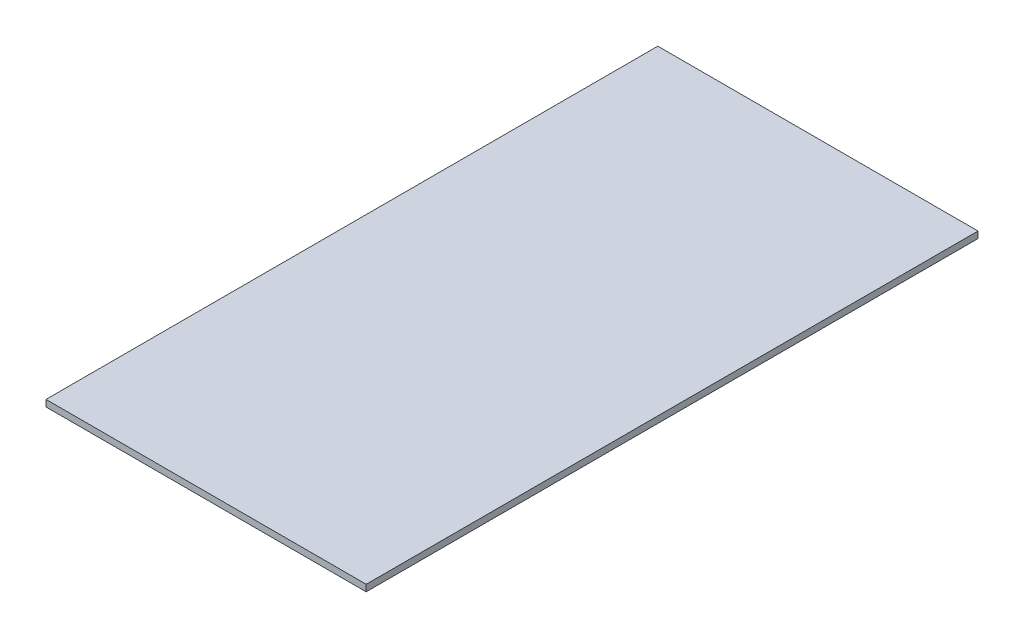
ISO-10303-21;
HEADER;
FILE_DESCRIPTION(('STEP AP214'),'2;1');
FILE_NAME('part.step','',(''),(''),'','','');
FILE_SCHEMA(('AUTOMOTIVE_DESIGN { 1 0 10303 214 1 1 1 1 }'));
ENDSEC;
DATA;
#1=APPLICATION_CONTEXT('core data for automotive mechanical design processes');
#2=APPLICATION_PROTOCOL_DEFINITION('international standard','automotive_design',2000,#1);
#3=PRODUCT_CONTEXT('',#1,'mechanical');
#4=PRODUCT('Part','Part','',(#3));
#5=PRODUCT_RELATED_PRODUCT_CATEGORY('part','',(#4));
#6=PRODUCT_DEFINITION_FORMATION('','',#4);
#7=PRODUCT_DEFINITION_CONTEXT('part definition',#1,'design');
#8=PRODUCT_DEFINITION('design','',#6,#7);
#9=PRODUCT_DEFINITION_SHAPE('','',#8);
#10=(LENGTH_UNIT() NAMED_UNIT(*) SI_UNIT(.MILLI.,.METRE.));
#11=(NAMED_UNIT(*) PLANE_ANGLE_UNIT() SI_UNIT($,.RADIAN.));
#12=(NAMED_UNIT(*) SI_UNIT($,.STERADIAN.) SOLID_ANGLE_UNIT());
#13=UNCERTAINTY_MEASURE_WITH_UNIT(LENGTH_MEASURE(1.E-05),#10,'distance_accuracy_value','');
#14=(GEOMETRIC_REPRESENTATION_CONTEXT(3) GLOBAL_UNCERTAINTY_ASSIGNED_CONTEXT((#13)) GLOBAL_UNIT_ASSIGNED_CONTEXT((#10,
#11,#12)) REPRESENTATION_CONTEXT('',''));
#15=CARTESIAN_POINT('',(0.,0.,0.));
#16=DIRECTION('',(0.,0.,1.));
#17=DIRECTION('',(1.,0.,0.));
#18=AXIS2_PLACEMENT_3D('',#15,#16,#17);
#19=CARTESIAN_POINT('',(0.,2.9972,0.));
#20=DIRECTION('',(1.,0.,0.));
#21=DIRECTION('',(0.,0.,-1.));
#22=AXIS2_PLACEMENT_3D('',#19,#20,#21);
#23=PLANE('',#22);
#24=DIRECTION('',(0.,0.,1.));
#25=VECTOR('',#24,1.);
#26=CARTESIAN_POINT('',(0.,0.,0.));
#27=LINE('',#26,#25);
#28=CARTESIAN_POINT('',(0.,0.,0.));
#29=VERTEX_POINT('',#28);
#30=CARTESIAN_POINT('',(0.,0.,279.7556));
#31=VERTEX_POINT('',#30);
#32=EDGE_CURVE('E98',#29,#31,#27,.T.);
#33=ORIENTED_EDGE('',*,*,#32,.T.);
#34=DIRECTION('',(0.,-1.,0.));
#35=VECTOR('',#34,1.);
#36=CARTESIAN_POINT('',(0.,2.9972,279.7556));
#37=LINE('',#36,#35);
#38=CARTESIAN_POINT('',(0.,2.9972,279.7556));
#39=VERTEX_POINT('',#38);
#40=EDGE_CURVE('E11',#39,#31,#37,.T.);
#41=ORIENTED_EDGE('',*,*,#40,.F.);
#42=DIRECTION('',(0.,0.,1.));
#43=VECTOR('',#42,1.);
#44=CARTESIAN_POINT('',(0.,2.9972,0.));
#45=LINE('',#44,#43);
#46=CARTESIAN_POINT('',(0.,2.9972,0.));
#47=VERTEX_POINT('',#46);
#48=EDGE_CURVE('E86',#47,#39,#45,.T.);
#49=ORIENTED_EDGE('',*,*,#48,.F.);
#50=DIRECTION('',(0.,-1.,0.));
#51=VECTOR('',#50,1.);
#52=CARTESIAN_POINT('',(0.,2.9972,0.));
#53=LINE('',#52,#51);
#54=EDGE_CURVE('E94',#47,#29,#53,.T.);
#55=ORIENTED_EDGE('',*,*,#54,.T.);
#56=EDGE_LOOP('',(#33,#41,#49,#55));
#57=FACE_BOUND('',#56,.T.);
#58=ADVANCED_FACE('F35',(#57),#23,.F.);
#59=CARTESIAN_POINT('',(0.,2.9972,279.7556));
#60=DIRECTION('',(0.,0.,-1.));
#61=DIRECTION('',(-1.,0.,0.));
#62=AXIS2_PLACEMENT_3D('',#59,#60,#61);
#63=PLANE('',#62);
#64=DIRECTION('',(1.,0.,0.));
#65=VECTOR('',#64,1.);
#66=CARTESIAN_POINT('',(0.,0.,279.7556));
#67=LINE('',#66,#65);
#68=CARTESIAN_POINT('',(146.4056,0.,279.7556));
#69=VERTEX_POINT('',#68);
#70=EDGE_CURVE('E90',#31,#69,#67,.T.);
#71=ORIENTED_EDGE('',*,*,#70,.T.);
#72=DIRECTION('',(0.,-1.,0.));
#73=VECTOR('',#72,1.);
#74=CARTESIAN_POINT('',(146.4056,2.9972,279.7556));
#75=LINE('',#74,#73);
#76=CARTESIAN_POINT('',(146.4056,2.9972,279.7556));
#77=VERTEX_POINT('',#76);
#78=EDGE_CURVE('E43',#77,#69,#75,.T.);
#79=ORIENTED_EDGE('',*,*,#78,.F.);
#80=DIRECTION('',(1.,0.,0.));
#81=VECTOR('',#80,1.);
#82=CARTESIAN_POINT('',(0.,2.9972,279.7556));
#83=LINE('',#82,#81);
#84=EDGE_CURVE('E81',#39,#77,#83,.T.);
#85=ORIENTED_EDGE('',*,*,#84,.F.);
#86=ORIENTED_EDGE('',*,*,#40,.T.);
#87=EDGE_LOOP('',(#71,#79,#85,#86));
#88=FACE_BOUND('',#87,.T.);
#89=ADVANCED_FACE('F89',(#88),#63,.F.);
#90=CARTESIAN_POINT('',(146.4056,2.9972,0.));
#91=DIRECTION('',(-1.,0.,0.));
#92=DIRECTION('',(0.,0.,1.));
#93=AXIS2_PLACEMENT_3D('',#90,#91,#92);
#94=PLANE('',#93);
#95=DIRECTION('',(0.,0.,-1.));
#96=VECTOR('',#95,1.);
#97=CARTESIAN_POINT('',(146.4056,0.,0.));
#98=LINE('',#97,#96);
#99=CARTESIAN_POINT('',(146.4056,0.,0.));
#100=VERTEX_POINT('',#99);
#101=EDGE_CURVE('E68',#69,#100,#98,.T.);
#102=ORIENTED_EDGE('',*,*,#101,.T.);
#103=DIRECTION('',(0.,-1.,0.));
#104=VECTOR('',#103,1.);
#105=CARTESIAN_POINT('',(146.4056,2.9972,0.));
#106=LINE('',#105,#104);
#107=CARTESIAN_POINT('',(146.4056,2.9972,0.));
#108=VERTEX_POINT('',#107);
#109=EDGE_CURVE('E91',#108,#100,#106,.T.);
#110=ORIENTED_EDGE('',*,*,#109,.F.);
#111=DIRECTION('',(0.,0.,-1.));
#112=VECTOR('',#111,1.);
#113=CARTESIAN_POINT('',(146.4056,2.9972,0.));
#114=LINE('',#113,#112);
#115=EDGE_CURVE('E84',#77,#108,#114,.T.);
#116=ORIENTED_EDGE('',*,*,#115,.F.);
#117=ORIENTED_EDGE('',*,*,#78,.T.);
#118=EDGE_LOOP('',(#102,#110,#116,#117));
#119=FACE_BOUND('',#118,.T.);
#120=ADVANCED_FACE('F92',(#119),#94,.F.);
#121=CARTESIAN_POINT('',(0.,2.9972,0.));
#122=DIRECTION('',(0.,0.,1.));
#123=DIRECTION('',(1.,0.,0.));
#124=AXIS2_PLACEMENT_3D('',#121,#122,#123);
#125=PLANE('',#124);
#126=DIRECTION('',(-1.,0.,0.));
#127=VECTOR('',#126,1.);
#128=CARTESIAN_POINT('',(0.,0.,0.));
#129=LINE('',#128,#127);
#130=EDGE_CURVE('E74',#100,#29,#129,.T.);
#131=ORIENTED_EDGE('',*,*,#130,.T.);
#132=ORIENTED_EDGE('',*,*,#54,.F.);
#133=DIRECTION('',(-1.,0.,0.));
#134=VECTOR('',#133,1.);
#135=CARTESIAN_POINT('',(0.,2.9972,0.));
#136=LINE('',#135,#134);
#137=EDGE_CURVE('E51',#108,#47,#136,.T.);
#138=ORIENTED_EDGE('',*,*,#137,.F.);
#139=ORIENTED_EDGE('',*,*,#109,.T.);
#140=EDGE_LOOP('',(#131,#132,#138,#139));
#141=FACE_BOUND('',#140,.T.);
#142=ADVANCED_FACE('F105',(#141),#125,.F.);
#143=CARTESIAN_POINT('',(0.,2.9972,0.));
#144=DIRECTION('',(0.,1.,0.));
#145=DIRECTION('',(0.,0.,1.));
#146=AXIS2_PLACEMENT_3D('',#143,#144,#145);
#147=PLANE('',#146);
#148=ORIENTED_EDGE('',*,*,#48,.T.);
#149=ORIENTED_EDGE('',*,*,#84,.T.);
#150=ORIENTED_EDGE('',*,*,#115,.T.);
#151=ORIENTED_EDGE('',*,*,#137,.T.);
#152=EDGE_LOOP('',(#148,#149,#150,#151));
#153=FACE_BOUND('',#152,.T.);
#154=ADVANCED_FACE('F82',(#153),#147,.T.);
#155=CARTESIAN_POINT('',(0.,0.,0.));
#156=DIRECTION('',(0.,1.,0.));
#157=DIRECTION('',(0.,0.,1.));
#158=AXIS2_PLACEMENT_3D('',#155,#156,#157);
#159=PLANE('',#158);
#160=ORIENTED_EDGE('',*,*,#32,.F.);
#161=ORIENTED_EDGE('',*,*,#130,.F.);
#162=ORIENTED_EDGE('',*,*,#101,.F.);
#163=ORIENTED_EDGE('',*,*,#70,.F.);
#164=EDGE_LOOP('',(#160,#161,#162,#163));
#165=FACE_BOUND('',#164,.T.);
#166=ADVANCED_FACE('F108',(#165),#159,.F.);
#167=CLOSED_SHELL('',(#58,#89,#120,#142,#154,#166));
#168=MANIFOLD_SOLID_BREP('B2',#167);
#169=ADVANCED_BREP_SHAPE_REPRESENTATION('',(#18,#168),#14);
#170=SHAPE_DEFINITION_REPRESENTATION(#9,#169);
ENDSEC;
END-ISO-10303-21;
